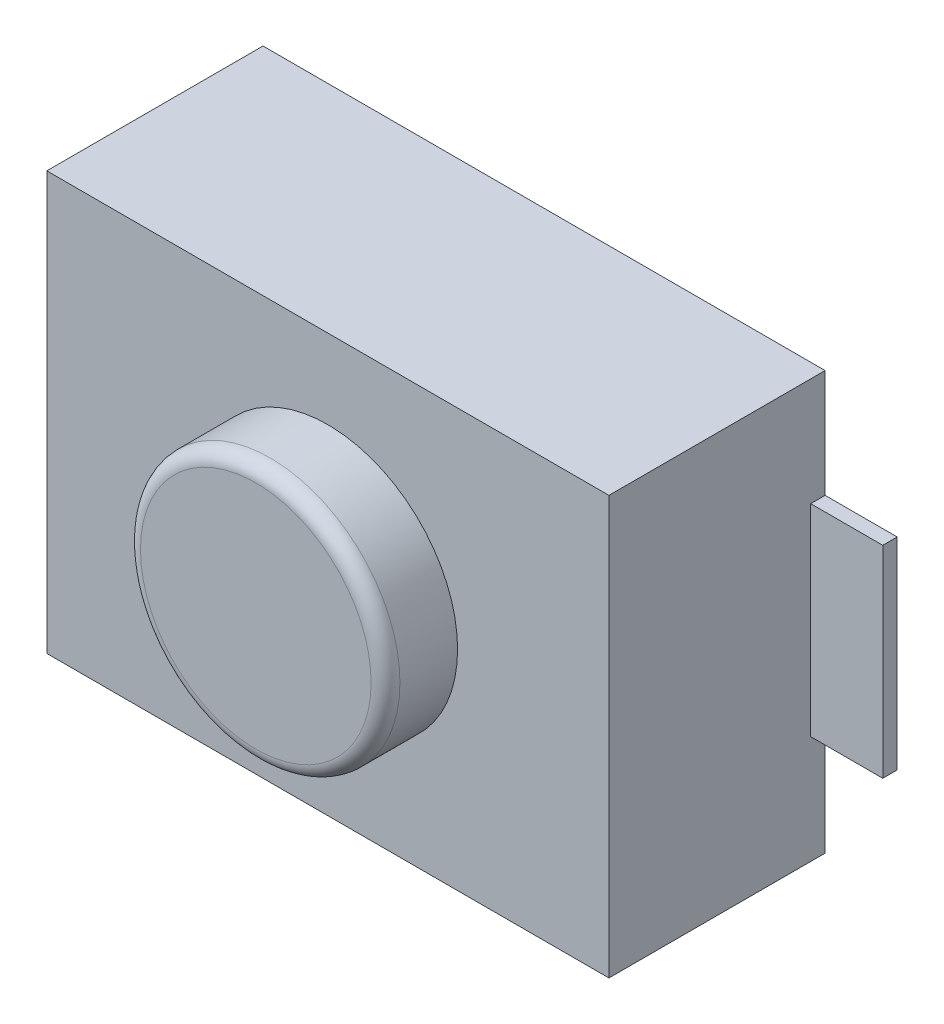
ISO-10303-21;
HEADER;
FILE_DESCRIPTION(('STEP AP214'),'2;1');
FILE_NAME('part.step','',(''),(''),'','','');
FILE_SCHEMA(('AUTOMOTIVE_DESIGN { 1 0 10303 214 1 1 1 1 }'));
ENDSEC;
DATA;
#1=APPLICATION_CONTEXT('core data for automotive mechanical design processes');
#2=APPLICATION_PROTOCOL_DEFINITION('international standard','automotive_design',2000,#1);
#3=PRODUCT_CONTEXT('',#1,'mechanical');
#4=PRODUCT('Part','Part','',(#3));
#5=PRODUCT_RELATED_PRODUCT_CATEGORY('part','',(#4));
#6=PRODUCT_DEFINITION_FORMATION('','',#4);
#7=PRODUCT_DEFINITION_CONTEXT('part definition',#1,'design');
#8=PRODUCT_DEFINITION('design','',#6,#7);
#9=PRODUCT_DEFINITION_SHAPE('','',#8);
#10=(LENGTH_UNIT() NAMED_UNIT(*) SI_UNIT(.MILLI.,.METRE.));
#11=(NAMED_UNIT(*) PLANE_ANGLE_UNIT() SI_UNIT($,.RADIAN.));
#12=(NAMED_UNIT(*) SI_UNIT($,.STERADIAN.) SOLID_ANGLE_UNIT());
#13=UNCERTAINTY_MEASURE_WITH_UNIT(LENGTH_MEASURE(1.E-05),#10,'distance_accuracy_value','');
#14=(GEOMETRIC_REPRESENTATION_CONTEXT(3) GLOBAL_UNCERTAINTY_ASSIGNED_CONTEXT((#13)) GLOBAL_UNIT_ASSIGNED_CONTEXT((#10,
#11,#12)) REPRESENTATION_CONTEXT('',''));
#15=CARTESIAN_POINT('',(0.,0.,0.));
#16=DIRECTION('',(0.,0.,1.));
#17=DIRECTION('',(1.,0.,0.));
#18=AXIS2_PLACEMENT_3D('',#15,#16,#17);
#19=CARTESIAN_POINT('',(0.,0.,1.9));
#20=DIRECTION('',(0.,0.,1.));
#21=DIRECTION('',(1.,0.,0.));
#22=AXIS2_PLACEMENT_3D('',#19,#20,#21);
#23=TOROIDAL_SURFACE('',#22,0.8,0.1);
#24=CARTESIAN_POINT('',(0.,0.,1.9));
#25=DIRECTION('',(0.,0.,-1.));
#26=DIRECTION('',(1.,0.,0.));
#27=AXIS2_PLACEMENT_3D('',#24,#25,#26);
#28=CIRCLE('',#27,0.9);
#29=CARTESIAN_POINT('',(0.9,0.,1.9));
#30=VERTEX_POINT('',#29);
#31=EDGE_CURVE('E28',#30,#30,#28,.T.);
#32=ORIENTED_EDGE('',*,*,#31,.F.);
#33=EDGE_LOOP('',(#32));
#34=FACE_BOUND('',#33,.T.);
#35=CARTESIAN_POINT('',(0.,0.,2.));
#36=DIRECTION('',(0.,0.,1.));
#37=DIRECTION('',(1.,0.,0.));
#38=AXIS2_PLACEMENT_3D('',#35,#36,#37);
#39=CIRCLE('',#38,0.8);
#40=CARTESIAN_POINT('',(0.8,0.,2.));
#41=VERTEX_POINT('',#40);
#42=EDGE_CURVE('E11',#41,#41,#39,.T.);
#43=ORIENTED_EDGE('',*,*,#42,.F.);
#44=EDGE_LOOP('',(#43));
#45=FACE_BOUND('',#44,.T.);
#46=ADVANCED_FACE('F17',(#34,#45),#23,.T.);
#47=CARTESIAN_POINT('',(-2.45,0.,0.1));
#48=DIRECTION('',(-1.,0.,0.));
#49=DIRECTION('',(0.,0.,1.));
#50=AXIS2_PLACEMENT_3D('',#47,#48,#49);
#51=PLANE('',#50);
#52=DIRECTION('',(0.,1.,0.));
#53=VECTOR('',#52,1.);
#54=CARTESIAN_POINT('',(-2.45,0.,0.));
#55=LINE('',#54,#53);
#56=CARTESIAN_POINT('',(-2.45,-0.7,0.));
#57=VERTEX_POINT('',#56);
#58=CARTESIAN_POINT('',(-2.45,0.7,0.));
#59=VERTEX_POINT('',#58);
#60=EDGE_CURVE('E214',#57,#59,#55,.T.);
#61=ORIENTED_EDGE('',*,*,#60,.F.);
#62=DIRECTION('',(0.,0.,-1.));
#63=VECTOR('',#62,1.);
#64=CARTESIAN_POINT('',(-2.45,-0.7,0.1));
#65=LINE('',#64,#63);
#66=CARTESIAN_POINT('',(-2.45,-0.7,0.1));
#67=VERTEX_POINT('',#66);
#68=EDGE_CURVE('E199',#67,#57,#65,.T.);
#69=ORIENTED_EDGE('',*,*,#68,.F.);
#70=DIRECTION('',(0.,1.,0.));
#71=VECTOR('',#70,1.);
#72=CARTESIAN_POINT('',(-2.45,0.,0.1));
#73=LINE('',#72,#71);
#74=CARTESIAN_POINT('',(-2.45,0.7,0.1));
#75=VERTEX_POINT('',#74);
#76=EDGE_CURVE('E170',#67,#75,#73,.T.);
#77=ORIENTED_EDGE('',*,*,#76,.T.);
#78=DIRECTION('',(0.,0.,-1.));
#79=VECTOR('',#78,1.);
#80=CARTESIAN_POINT('',(-2.45,0.7,0.1));
#81=LINE('',#80,#79);
#82=EDGE_CURVE('E213',#75,#59,#81,.T.);
#83=ORIENTED_EDGE('',*,*,#82,.T.);
#84=EDGE_LOOP('',(#61,#69,#77,#83));
#85=FACE_BOUND('',#84,.T.);
#86=ADVANCED_FACE('F289',(#85),#51,.T.);
#87=CARTESIAN_POINT('',(2.45,0.,0.1));
#88=DIRECTION('',(-1.,0.,0.));
#89=DIRECTION('',(0.,0.,1.));
#90=AXIS2_PLACEMENT_3D('',#87,#88,#89);
#91=PLANE('',#90);
#92=DIRECTION('',(0.,1.,0.));
#93=VECTOR('',#92,1.);
#94=CARTESIAN_POINT('',(2.45,0.,0.));
#95=LINE('',#94,#93);
#96=CARTESIAN_POINT('',(2.45,-0.7,0.));
#97=VERTEX_POINT('',#96);
#98=CARTESIAN_POINT('',(2.45,0.7,0.));
#99=VERTEX_POINT('',#98);
#100=EDGE_CURVE('E144',#97,#99,#95,.T.);
#101=ORIENTED_EDGE('',*,*,#100,.T.);
#102=DIRECTION('',(0.,0.,-1.));
#103=VECTOR('',#102,1.);
#104=CARTESIAN_POINT('',(2.45,0.7,0.1));
#105=LINE('',#104,#103);
#106=CARTESIAN_POINT('',(2.45,0.7,0.1));
#107=VERTEX_POINT('',#106);
#108=EDGE_CURVE('E83',#107,#99,#105,.T.);
#109=ORIENTED_EDGE('',*,*,#108,.F.);
#110=DIRECTION('',(0.,1.,0.));
#111=VECTOR('',#110,1.);
#112=CARTESIAN_POINT('',(2.45,0.,0.1));
#113=LINE('',#112,#111);
#114=CARTESIAN_POINT('',(2.45,-0.7,0.1));
#115=VERTEX_POINT('',#114);
#116=EDGE_CURVE('E223',#115,#107,#113,.T.);
#117=ORIENTED_EDGE('',*,*,#116,.F.);
#118=DIRECTION('',(0.,0.,-1.));
#119=VECTOR('',#118,1.);
#120=CARTESIAN_POINT('',(2.45,-0.7,0.1));
#121=LINE('',#120,#119);
#122=EDGE_CURVE('E191',#115,#97,#121,.T.);
#123=ORIENTED_EDGE('',*,*,#122,.T.);
#124=EDGE_LOOP('',(#101,#109,#117,#123));
#125=FACE_BOUND('',#124,.T.);
#126=ADVANCED_FACE('F360',(#125),#91,.F.);
#127=CARTESIAN_POINT('',(0.,0.,2.));
#128=DIRECTION('',(0.,0.,1.));
#129=DIRECTION('',(1.,0.,0.));
#130=AXIS2_PLACEMENT_3D('',#127,#128,#129);
#131=PLANE('',#130);
#132=ORIENTED_EDGE('',*,*,#42,.T.);
#133=EDGE_LOOP('',(#132));
#134=FACE_BOUND('',#133,.T.);
#135=ADVANCED_FACE('F19',(#134),#131,.T.);
#136=CARTESIAN_POINT('',(0.,0.,2.));
#137=DIRECTION('',(0.,0.,1.));
#138=DIRECTION('',(-1.,0.,0.));
#139=AXIS2_PLACEMENT_3D('',#136,#137,#138);
#140=CYLINDRICAL_SURFACE('',#139,0.9);
#141=ORIENTED_EDGE('',*,*,#31,.T.);
#142=EDGE_LOOP('',(#141));
#143=FACE_BOUND('',#142,.T.);
#144=CARTESIAN_POINT('',(0.,0.,1.5));
#145=DIRECTION('',(0.,0.,1.));
#146=DIRECTION('',(1.,0.,0.));
#147=AXIS2_PLACEMENT_3D('',#144,#145,#146);
#148=CIRCLE('',#147,0.9);
#149=CARTESIAN_POINT('',(0.9,0.,1.5));
#150=VERTEX_POINT('',#149);
#151=EDGE_CURVE('E198',#150,#150,#148,.T.);
#152=ORIENTED_EDGE('',*,*,#151,.T.);
#153=EDGE_LOOP('',(#152));
#154=FACE_BOUND('',#153,.T.);
#155=ADVANCED_FACE('F366',(#143,#154),#140,.T.);
#156=CARTESIAN_POINT('',(0.,0.,1.5));
#157=DIRECTION('',(0.,0.,1.));
#158=DIRECTION('',(1.,0.,0.));
#159=AXIS2_PLACEMENT_3D('',#156,#157,#158);
#160=PLANE('',#159);
#161=ORIENTED_EDGE('',*,*,#151,.F.);
#162=EDGE_LOOP('',(#161));
#163=FACE_BOUND('',#162,.T.);
#164=DIRECTION('',(-1.,0.,0.));
#165=VECTOR('',#164,1.);
#166=CARTESIAN_POINT('',(0.,-1.45,1.5));
#167=LINE('',#166,#165);
#168=CARTESIAN_POINT('',(1.95,-1.45,1.5));
#169=VERTEX_POINT('',#168);
#170=CARTESIAN_POINT('',(-1.95,-1.45,1.5));
#171=VERTEX_POINT('',#170);
#172=EDGE_CURVE('E186',#169,#171,#167,.T.);
#173=ORIENTED_EDGE('',*,*,#172,.F.);
#174=DIRECTION('',(0.,1.,0.));
#175=VECTOR('',#174,1.);
#176=CARTESIAN_POINT('',(1.95,0.,1.5));
#177=LINE('',#176,#175);
#178=CARTESIAN_POINT('',(1.95,1.45,1.5));
#179=VERTEX_POINT('',#178);
#180=EDGE_CURVE('E236',#169,#179,#177,.T.);
#181=ORIENTED_EDGE('',*,*,#180,.T.);
#182=DIRECTION('',(-1.,0.,0.));
#183=VECTOR('',#182,1.);
#184=CARTESIAN_POINT('',(0.,1.45,1.5));
#185=LINE('',#184,#183);
#186=CARTESIAN_POINT('',(-1.95,1.45,1.5));
#187=VERTEX_POINT('',#186);
#188=EDGE_CURVE('E245',#179,#187,#185,.T.);
#189=ORIENTED_EDGE('',*,*,#188,.T.);
#190=DIRECTION('',(0.,1.,0.));
#191=VECTOR('',#190,1.);
#192=CARTESIAN_POINT('',(-1.95,0.,1.5));
#193=LINE('',#192,#191);
#194=EDGE_CURVE('E190',#171,#187,#193,.T.);
#195=ORIENTED_EDGE('',*,*,#194,.F.);
#196=EDGE_LOOP('',(#173,#181,#189,#195));
#197=FACE_BOUND('',#196,.T.);
#198=ADVANCED_FACE('F336',(#163,#197),#160,.T.);
#199=CARTESIAN_POINT('',(0.,0.,0.));
#200=DIRECTION('',(0.,0.,1.));
#201=DIRECTION('',(1.,0.,0.));
#202=AXIS2_PLACEMENT_3D('',#199,#200,#201);
#203=PLANE('',#202);
#204=DIRECTION('',(0.,1.,0.));
#205=VECTOR('',#204,1.);
#206=CARTESIAN_POINT('',(1.95,0.,0.));
#207=LINE('',#206,#205);
#208=CARTESIAN_POINT('',(1.95,0.7,0.));
#209=VERTEX_POINT('',#208);
#210=CARTESIAN_POINT('',(1.95,1.45,0.));
#211=VERTEX_POINT('',#210);
#212=EDGE_CURVE('E21',#209,#211,#207,.T.);
#213=ORIENTED_EDGE('',*,*,#212,.F.);
#214=DIRECTION('',(-1.,0.,0.));
#215=VECTOR('',#214,1.);
#216=CARTESIAN_POINT('',(0.,0.7,0.));
#217=LINE('',#216,#215);
#218=EDGE_CURVE('E152',#99,#209,#217,.T.);
#219=ORIENTED_EDGE('',*,*,#218,.F.);
#220=ORIENTED_EDGE('',*,*,#100,.F.);
#221=DIRECTION('',(-1.,0.,0.));
#222=VECTOR('',#221,1.);
#223=CARTESIAN_POINT('',(0.,-0.7,0.));
#224=LINE('',#223,#222);
#225=CARTESIAN_POINT('',(1.95,-0.7,0.));
#226=VERTEX_POINT('',#225);
#227=EDGE_CURVE('E195',#97,#226,#224,.T.);
#228=ORIENTED_EDGE('',*,*,#227,.T.);
#229=DIRECTION('',(0.,1.,0.));
#230=VECTOR('',#229,1.);
#231=CARTESIAN_POINT('',(1.95,0.,0.));
#232=LINE('',#231,#230);
#233=CARTESIAN_POINT('',(1.95,-1.45,0.));
#234=VERTEX_POINT('',#233);
#235=EDGE_CURVE('E160',#234,#226,#232,.T.);
#236=ORIENTED_EDGE('',*,*,#235,.F.);
#237=DIRECTION('',(-1.,0.,0.));
#238=VECTOR('',#237,1.);
#239=CARTESIAN_POINT('',(0.,-1.45,0.));
#240=LINE('',#239,#238);
#241=CARTESIAN_POINT('',(-1.95,-1.45,0.));
#242=VERTEX_POINT('',#241);
#243=EDGE_CURVE('E208',#234,#242,#240,.T.);
#244=ORIENTED_EDGE('',*,*,#243,.T.);
#245=DIRECTION('',(0.,1.,0.));
#246=VECTOR('',#245,1.);
#247=CARTESIAN_POINT('',(-1.95,0.,0.));
#248=LINE('',#247,#246);
#249=CARTESIAN_POINT('',(-1.95,-0.7,0.));
#250=VERTEX_POINT('',#249);
#251=EDGE_CURVE('E249',#242,#250,#248,.T.);
#252=ORIENTED_EDGE('',*,*,#251,.T.);
#253=DIRECTION('',(-1.,0.,0.));
#254=VECTOR('',#253,1.);
#255=CARTESIAN_POINT('',(0.,-0.7,0.));
#256=LINE('',#255,#254);
#257=EDGE_CURVE('E179',#250,#57,#256,.T.);
#258=ORIENTED_EDGE('',*,*,#257,.T.);
#259=ORIENTED_EDGE('',*,*,#60,.T.);
#260=DIRECTION('',(-1.,0.,0.));
#261=VECTOR('',#260,1.);
#262=CARTESIAN_POINT('',(0.,0.7,0.));
#263=LINE('',#262,#261);
#264=CARTESIAN_POINT('',(-1.95,0.7,0.));
#265=VERTEX_POINT('',#264);
#266=EDGE_CURVE('E220',#265,#59,#263,.T.);
#267=ORIENTED_EDGE('',*,*,#266,.F.);
#268=DIRECTION('',(0.,1.,0.));
#269=VECTOR('',#268,1.);
#270=CARTESIAN_POINT('',(-1.95,0.,0.));
#271=LINE('',#270,#269);
#272=CARTESIAN_POINT('',(-1.95,1.45,0.));
#273=VERTEX_POINT('',#272);
#274=EDGE_CURVE('E187',#265,#273,#271,.T.);
#275=ORIENTED_EDGE('',*,*,#274,.T.);
#276=DIRECTION('',(-1.,0.,0.));
#277=VECTOR('',#276,1.);
#278=CARTESIAN_POINT('',(0.,1.45,0.));
#279=LINE('',#278,#277);
#280=EDGE_CURVE('E154',#211,#273,#279,.T.);
#281=ORIENTED_EDGE('',*,*,#280,.F.);
#282=EDGE_LOOP('',(#213,#219,#220,#228,#236,#244,#252,#258,#259,#267,#275,#281));
#283=FACE_BOUND('',#282,.T.);
#284=ADVANCED_FACE('F151',(#283),#203,.F.);
#285=CARTESIAN_POINT('',(-1.95,0.,1.5));
#286=DIRECTION('',(-1.,0.,0.));
#287=DIRECTION('',(0.,0.,1.));
#288=AXIS2_PLACEMENT_3D('',#285,#286,#287);
#289=PLANE('',#288);
#290=DIRECTION('',(0.,0.,1.));
#291=VECTOR('',#290,1.);
#292=CARTESIAN_POINT('',(-1.95,-0.7,1.5));
#293=LINE('',#292,#291);
#294=CARTESIAN_POINT('',(-1.95,-0.7,0.1));
#295=VERTEX_POINT('',#294);
#296=EDGE_CURVE('E254',#250,#295,#293,.T.);
#297=ORIENTED_EDGE('',*,*,#296,.F.);
#298=ORIENTED_EDGE('',*,*,#251,.F.);
#299=DIRECTION('',(0.,0.,-1.));
#300=VECTOR('',#299,1.);
#301=CARTESIAN_POINT('',(-1.95,-1.45,1.5));
#302=LINE('',#301,#300);
#303=EDGE_CURVE('E182',#171,#242,#302,.T.);
#304=ORIENTED_EDGE('',*,*,#303,.F.);
#305=ORIENTED_EDGE('',*,*,#194,.T.);
#306=DIRECTION('',(0.,0.,-1.));
#307=VECTOR('',#306,1.);
#308=CARTESIAN_POINT('',(-1.95,1.45,1.5));
#309=LINE('',#308,#307);
#310=EDGE_CURVE('E250',#187,#273,#309,.T.);
#311=ORIENTED_EDGE('',*,*,#310,.T.);
#312=ORIENTED_EDGE('',*,*,#274,.F.);
#313=DIRECTION('',(0.,0.,1.));
#314=VECTOR('',#313,1.);
#315=CARTESIAN_POINT('',(-1.95,0.7,1.5));
#316=LINE('',#315,#314);
#317=CARTESIAN_POINT('',(-1.95,0.7,0.1));
#318=VERTEX_POINT('',#317);
#319=EDGE_CURVE('E207',#265,#318,#316,.T.);
#320=ORIENTED_EDGE('',*,*,#319,.T.);
#321=DIRECTION('',(0.,-1.,0.));
#322=VECTOR('',#321,1.);
#323=CARTESIAN_POINT('',(-1.95,0.,0.1));
#324=LINE('',#323,#322);
#325=EDGE_CURVE('E229',#318,#295,#324,.T.);
#326=ORIENTED_EDGE('',*,*,#325,.T.);
#327=EDGE_LOOP('',(#297,#298,#304,#305,#311,#312,#320,#326));
#328=FACE_BOUND('',#327,.T.);
#329=ADVANCED_FACE('F296',(#328),#289,.T.);
#330=CARTESIAN_POINT('',(0.,1.45,1.5));
#331=DIRECTION('',(0.,-1.,0.));
#332=DIRECTION('',(0.,0.,-1.));
#333=AXIS2_PLACEMENT_3D('',#330,#331,#332);
#334=PLANE('',#333);
#335=ORIENTED_EDGE('',*,*,#280,.T.);
#336=ORIENTED_EDGE('',*,*,#310,.F.);
#337=ORIENTED_EDGE('',*,*,#188,.F.);
#338=DIRECTION('',(0.,0.,-1.));
#339=VECTOR('',#338,1.);
#340=CARTESIAN_POINT('',(1.95,1.45,1.5));
#341=LINE('',#340,#339);
#342=EDGE_CURVE('E159',#179,#211,#341,.T.);
#343=ORIENTED_EDGE('',*,*,#342,.T.);
#344=EDGE_LOOP('',(#335,#336,#337,#343));
#345=FACE_BOUND('',#344,.T.);
#346=ADVANCED_FACE('F338',(#345),#334,.F.);
#347=CARTESIAN_POINT('',(1.95,0.,1.5));
#348=DIRECTION('',(-1.,0.,0.));
#349=DIRECTION('',(0.,0.,1.));
#350=AXIS2_PLACEMENT_3D('',#347,#348,#349);
#351=PLANE('',#350);
#352=ORIENTED_EDGE('',*,*,#235,.T.);
#353=DIRECTION('',(0.,0.,1.));
#354=VECTOR('',#353,1.);
#355=CARTESIAN_POINT('',(1.95,-0.7,1.5));
#356=LINE('',#355,#354);
#357=CARTESIAN_POINT('',(1.95,-0.7,0.1));
#358=VERTEX_POINT('',#357);
#359=EDGE_CURVE('E242',#226,#358,#356,.T.);
#360=ORIENTED_EDGE('',*,*,#359,.T.);
#361=DIRECTION('',(0.,-1.,0.));
#362=VECTOR('',#361,1.);
#363=CARTESIAN_POINT('',(1.95,0.,0.1));
#364=LINE('',#363,#362);
#365=CARTESIAN_POINT('',(1.95,0.7,0.1));
#366=VERTEX_POINT('',#365);
#367=EDGE_CURVE('E164',#366,#358,#364,.T.);
#368=ORIENTED_EDGE('',*,*,#367,.F.);
#369=DIRECTION('',(0.,0.,1.));
#370=VECTOR('',#369,1.);
#371=CARTESIAN_POINT('',(1.95,0.7,1.5));
#372=LINE('',#371,#370);
#373=EDGE_CURVE('E66',#209,#366,#372,.T.);
#374=ORIENTED_EDGE('',*,*,#373,.F.);
#375=ORIENTED_EDGE('',*,*,#212,.T.);
#376=ORIENTED_EDGE('',*,*,#342,.F.);
#377=ORIENTED_EDGE('',*,*,#180,.F.);
#378=DIRECTION('',(0.,0.,-1.));
#379=VECTOR('',#378,1.);
#380=CARTESIAN_POINT('',(1.95,-1.45,1.5));
#381=LINE('',#380,#379);
#382=EDGE_CURVE('E212',#169,#234,#381,.T.);
#383=ORIENTED_EDGE('',*,*,#382,.T.);
#384=EDGE_LOOP('',(#352,#360,#368,#374,#375,#376,#377,#383));
#385=FACE_BOUND('',#384,.T.);
#386=ADVANCED_FACE('F161',(#385),#351,.F.);
#387=CARTESIAN_POINT('',(0.,-1.45,1.5));
#388=DIRECTION('',(0.,-1.,0.));
#389=DIRECTION('',(0.,0.,-1.));
#390=AXIS2_PLACEMENT_3D('',#387,#388,#389);
#391=PLANE('',#390);
#392=ORIENTED_EDGE('',*,*,#243,.F.);
#393=ORIENTED_EDGE('',*,*,#382,.F.);
#394=ORIENTED_EDGE('',*,*,#172,.T.);
#395=ORIENTED_EDGE('',*,*,#303,.T.);
#396=EDGE_LOOP('',(#392,#393,#394,#395));
#397=FACE_BOUND('',#396,.T.);
#398=ADVANCED_FACE('F334',(#397),#391,.T.);
#399=CARTESIAN_POINT('',(0.,0.7,0.1));
#400=DIRECTION('',(0.,-1.,0.));
#401=DIRECTION('',(0.,0.,-1.));
#402=AXIS2_PLACEMENT_3D('',#399,#400,#401);
#403=PLANE('',#402);
#404=ORIENTED_EDGE('',*,*,#319,.F.);
#405=ORIENTED_EDGE('',*,*,#266,.T.);
#406=ORIENTED_EDGE('',*,*,#82,.F.);
#407=DIRECTION('',(-1.,0.,0.));
#408=VECTOR('',#407,1.);
#409=CARTESIAN_POINT('',(0.,0.7,0.1));
#410=LINE('',#409,#408);
#411=EDGE_CURVE('E176',#318,#75,#410,.T.);
#412=ORIENTED_EDGE('',*,*,#411,.F.);
#413=EDGE_LOOP('',(#404,#405,#406,#412));
#414=FACE_BOUND('',#413,.T.);
#415=ADVANCED_FACE('F285',(#414),#403,.F.);
#416=CARTESIAN_POINT('',(0.,0.7,0.1));
#417=DIRECTION('',(0.,-1.,0.));
#418=DIRECTION('',(0.,0.,-1.));
#419=AXIS2_PLACEMENT_3D('',#416,#417,#418);
#420=PLANE('',#419);
#421=ORIENTED_EDGE('',*,*,#218,.T.);
#422=ORIENTED_EDGE('',*,*,#373,.T.);
#423=DIRECTION('',(-1.,0.,0.));
#424=VECTOR('',#423,1.);
#425=CARTESIAN_POINT('',(0.,0.7,0.1));
#426=LINE('',#425,#424);
#427=EDGE_CURVE('E203',#107,#366,#426,.T.);
#428=ORIENTED_EDGE('',*,*,#427,.F.);
#429=ORIENTED_EDGE('',*,*,#108,.T.);
#430=EDGE_LOOP('',(#421,#422,#428,#429));
#431=FACE_BOUND('',#430,.T.);
#432=ADVANCED_FACE('F168',(#431),#420,.F.);
#433=CARTESIAN_POINT('',(0.,0.,0.1));
#434=DIRECTION('',(0.,0.,-1.));
#435=DIRECTION('',(0.,-1.,0.));
#436=AXIS2_PLACEMENT_3D('',#433,#434,#435);
#437=PLANE('',#436);
#438=ORIENTED_EDGE('',*,*,#325,.F.);
#439=ORIENTED_EDGE('',*,*,#411,.T.);
#440=ORIENTED_EDGE('',*,*,#76,.F.);
#441=DIRECTION('',(-1.,0.,0.));
#442=VECTOR('',#441,1.);
#443=CARTESIAN_POINT('',(0.,-0.7,0.1));
#444=LINE('',#443,#442);
#445=EDGE_CURVE('E204',#295,#67,#444,.T.);
#446=ORIENTED_EDGE('',*,*,#445,.F.);
#447=EDGE_LOOP('',(#438,#439,#440,#446));
#448=FACE_BOUND('',#447,.T.);
#449=ADVANCED_FACE('F280',(#448),#437,.F.);
#450=CARTESIAN_POINT('',(0.,0.,0.1));
#451=DIRECTION('',(0.,0.,-1.));
#452=DIRECTION('',(0.,-1.,0.));
#453=AXIS2_PLACEMENT_3D('',#450,#451,#452);
#454=PLANE('',#453);
#455=ORIENTED_EDGE('',*,*,#427,.T.);
#456=ORIENTED_EDGE('',*,*,#367,.T.);
#457=DIRECTION('',(-1.,0.,0.));
#458=VECTOR('',#457,1.);
#459=CARTESIAN_POINT('',(0.,-0.7,0.1));
#460=LINE('',#459,#458);
#461=EDGE_CURVE('E194',#115,#358,#460,.T.);
#462=ORIENTED_EDGE('',*,*,#461,.F.);
#463=ORIENTED_EDGE('',*,*,#116,.T.);
#464=EDGE_LOOP('',(#455,#456,#462,#463));
#465=FACE_BOUND('',#464,.T.);
#466=ADVANCED_FACE('F321',(#465),#454,.F.);
#467=CARTESIAN_POINT('',(0.,-0.7,0.1));
#468=DIRECTION('',(0.,-1.,0.));
#469=DIRECTION('',(0.,0.,-1.));
#470=AXIS2_PLACEMENT_3D('',#467,#468,#469);
#471=PLANE('',#470);
#472=ORIENTED_EDGE('',*,*,#257,.F.);
#473=ORIENTED_EDGE('',*,*,#296,.T.);
#474=ORIENTED_EDGE('',*,*,#445,.T.);
#475=ORIENTED_EDGE('',*,*,#68,.T.);
#476=EDGE_LOOP('',(#472,#473,#474,#475));
#477=FACE_BOUND('',#476,.T.);
#478=ADVANCED_FACE('F293',(#477),#471,.T.);
#479=CARTESIAN_POINT('',(0.,-0.7,0.1));
#480=DIRECTION('',(0.,-1.,0.));
#481=DIRECTION('',(0.,0.,-1.));
#482=AXIS2_PLACEMENT_3D('',#479,#480,#481);
#483=PLANE('',#482);
#484=ORIENTED_EDGE('',*,*,#359,.F.);
#485=ORIENTED_EDGE('',*,*,#227,.F.);
#486=ORIENTED_EDGE('',*,*,#122,.F.);
#487=ORIENTED_EDGE('',*,*,#461,.T.);
#488=EDGE_LOOP('',(#484,#485,#486,#487));
#489=FACE_BOUND('',#488,.T.);
#490=ADVANCED_FACE('F319',(#489),#483,.T.);
#491=CLOSED_SHELL('',(#46,#86,#126,#135,#155,#198,#284,#329,#346,#386,#398,#415,#432,#449,#466,
#478,#490));
#492=MANIFOLD_SOLID_BREP('B1',#491);
#493=ADVANCED_BREP_SHAPE_REPRESENTATION('',(#18,#492),#14);
#494=SHAPE_DEFINITION_REPRESENTATION(#9,#493);
ENDSEC;
END-ISO-10303-21;
